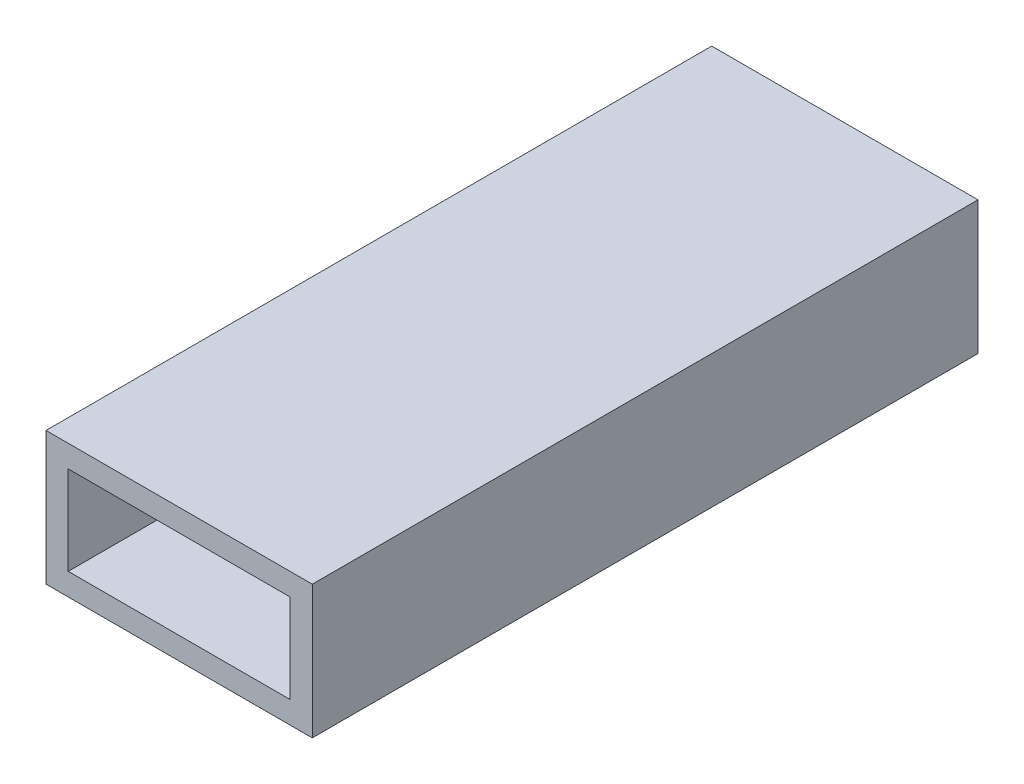
ISO-10303-21;
HEADER;
FILE_DESCRIPTION(('STEP AP214'),'2;1');
FILE_NAME('part.step','',(''),(''),'','','');
FILE_SCHEMA(('AUTOMOTIVE_DESIGN { 1 0 10303 214 1 1 1 1 }'));
ENDSEC;
DATA;
#1=APPLICATION_CONTEXT('core data for automotive mechanical design processes');
#2=APPLICATION_PROTOCOL_DEFINITION('international standard','automotive_design',2000,#1);
#3=PRODUCT_CONTEXT('',#1,'mechanical');
#4=PRODUCT('Part','Part','',(#3));
#5=PRODUCT_RELATED_PRODUCT_CATEGORY('part','',(#4));
#6=PRODUCT_DEFINITION_FORMATION('','',#4);
#7=PRODUCT_DEFINITION_CONTEXT('part definition',#1,'design');
#8=PRODUCT_DEFINITION('design','',#6,#7);
#9=PRODUCT_DEFINITION_SHAPE('','',#8);
#10=(LENGTH_UNIT() NAMED_UNIT(*) SI_UNIT(.MILLI.,.METRE.));
#11=(NAMED_UNIT(*) PLANE_ANGLE_UNIT() SI_UNIT($,.RADIAN.));
#12=(NAMED_UNIT(*) SI_UNIT($,.STERADIAN.) SOLID_ANGLE_UNIT());
#13=UNCERTAINTY_MEASURE_WITH_UNIT(LENGTH_MEASURE(1.E-05),#10,'distance_accuracy_value','');
#14=(GEOMETRIC_REPRESENTATION_CONTEXT(3) GLOBAL_UNCERTAINTY_ASSIGNED_CONTEXT((#13)) GLOBAL_UNIT_ASSIGNED_CONTEXT((#10,
#11,#12)) REPRESENTATION_CONTEXT('',''));
#15=CARTESIAN_POINT('',(0.,0.,0.));
#16=DIRECTION('',(0.,0.,1.));
#17=DIRECTION('',(1.,0.,0.));
#18=AXIS2_PLACEMENT_3D('',#15,#16,#17);
#19=CARTESIAN_POINT('',(-30.,30.,75.));
#20=DIRECTION('',(0.,0.,-1.));
#21=DIRECTION('',(-1.,0.,0.));
#22=AXIS2_PLACEMENT_3D('',#19,#20,#21);
#23=PLANE('',#22);
#24=DIRECTION('',(1.,0.,0.));
#25=VECTOR('',#24,1.);
#26=CARTESIAN_POINT('',(-30.,0.,75.));
#27=LINE('',#26,#25);
#28=CARTESIAN_POINT('',(-30.,0.,75.));
#29=VERTEX_POINT('',#28);
#30=CARTESIAN_POINT('',(30.,0.,75.));
#31=VERTEX_POINT('',#30);
#32=EDGE_CURVE('E158',#29,#31,#27,.T.);
#33=ORIENTED_EDGE('',*,*,#32,.T.);
#34=DIRECTION('',(0.,-1.,0.));
#35=VECTOR('',#34,1.);
#36=CARTESIAN_POINT('',(30.,30.,75.));
#37=LINE('',#36,#35);
#38=CARTESIAN_POINT('',(30.,30.,75.));
#39=VERTEX_POINT('',#38);
#40=EDGE_CURVE('E43',#39,#31,#37,.T.);
#41=ORIENTED_EDGE('',*,*,#40,.F.);
#42=DIRECTION('',(1.,0.,0.));
#43=VECTOR('',#42,1.);
#44=CARTESIAN_POINT('',(-30.,30.,75.));
#45=LINE('',#44,#43);
#46=CARTESIAN_POINT('',(-30.,30.,75.));
#47=VERTEX_POINT('',#46);
#48=EDGE_CURVE('E87',#47,#39,#45,.T.);
#49=ORIENTED_EDGE('',*,*,#48,.F.);
#50=DIRECTION('',(0.,-1.,0.));
#51=VECTOR('',#50,1.);
#52=CARTESIAN_POINT('',(-30.,30.,75.));
#53=LINE('',#52,#51);
#54=EDGE_CURVE('E11',#47,#29,#53,.T.);
#55=ORIENTED_EDGE('',*,*,#54,.T.);
#56=EDGE_LOOP('',(#33,#41,#49,#55));
#57=FACE_BOUND('',#56,.T.);
#58=DIRECTION('',(0.,-1.,0.));
#59=VECTOR('',#58,1.);
#60=CARTESIAN_POINT('',(-25.,25.,75.));
#61=LINE('',#60,#59);
#62=CARTESIAN_POINT('',(-25.,25.,75.));
#63=VERTEX_POINT('',#62);
#64=CARTESIAN_POINT('',(-25.,5.,75.));
#65=VERTEX_POINT('',#64);
#66=EDGE_CURVE('E117',#63,#65,#61,.T.);
#67=ORIENTED_EDGE('',*,*,#66,.F.);
#68=DIRECTION('',(-1.,0.,0.));
#69=VECTOR('',#68,1.);
#70=CARTESIAN_POINT('',(-25.,25.,75.));
#71=LINE('',#70,#69);
#72=CARTESIAN_POINT('',(25.,25.,75.));
#73=VERTEX_POINT('',#72);
#74=EDGE_CURVE('E143',#73,#63,#71,.T.);
#75=ORIENTED_EDGE('',*,*,#74,.F.);
#76=DIRECTION('',(0.,1.,0.));
#77=VECTOR('',#76,1.);
#78=CARTESIAN_POINT('',(25.,25.,75.));
#79=LINE('',#78,#77);
#80=CARTESIAN_POINT('',(25.,5.,75.));
#81=VERTEX_POINT('',#80);
#82=EDGE_CURVE('E141',#81,#73,#79,.T.);
#83=ORIENTED_EDGE('',*,*,#82,.F.);
#84=DIRECTION('',(1.,0.,0.));
#85=VECTOR('',#84,1.);
#86=CARTESIAN_POINT('',(-25.,5.,75.));
#87=LINE('',#86,#85);
#88=EDGE_CURVE('E139',#65,#81,#87,.T.);
#89=ORIENTED_EDGE('',*,*,#88,.F.);
#90=EDGE_LOOP('',(#67,#75,#83,#89));
#91=FACE_BOUND('',#90,.T.);
#92=ADVANCED_FACE('F35',(#57,#91),#23,.F.);
#93=CARTESIAN_POINT('',(-30.,30.,-75.));
#94=DIRECTION('',(1.,0.,0.));
#95=DIRECTION('',(0.,0.,-1.));
#96=AXIS2_PLACEMENT_3D('',#93,#94,#95);
#97=PLANE('',#96);
#98=DIRECTION('',(0.,0.,1.));
#99=VECTOR('',#98,1.);
#100=CARTESIAN_POINT('',(-30.,0.,-75.));
#101=LINE('',#100,#99);
#102=CARTESIAN_POINT('',(-30.,0.,-75.));
#103=VERTEX_POINT('',#102);
#104=EDGE_CURVE('E120',#103,#29,#101,.T.);
#105=ORIENTED_EDGE('',*,*,#104,.T.);
#106=ORIENTED_EDGE('',*,*,#54,.F.);
#107=DIRECTION('',(0.,0.,1.));
#108=VECTOR('',#107,1.);
#109=CARTESIAN_POINT('',(-30.,30.,-75.));
#110=LINE('',#109,#108);
#111=CARTESIAN_POINT('',(-30.,30.,-75.));
#112=VERTEX_POINT('',#111);
#113=EDGE_CURVE('E149',#112,#47,#110,.T.);
#114=ORIENTED_EDGE('',*,*,#113,.F.);
#115=DIRECTION('',(0.,-1.,0.));
#116=VECTOR('',#115,1.);
#117=CARTESIAN_POINT('',(-30.,30.,-75.));
#118=LINE('',#117,#116);
#119=EDGE_CURVE('E155',#112,#103,#118,.T.);
#120=ORIENTED_EDGE('',*,*,#119,.T.);
#121=EDGE_LOOP('',(#105,#106,#114,#120));
#122=FACE_BOUND('',#121,.T.);
#123=ADVANCED_FACE('F37',(#122),#97,.F.);
#124=CARTESIAN_POINT('',(30.,30.,-75.));
#125=DIRECTION('',(-1.,0.,0.));
#126=DIRECTION('',(0.,0.,1.));
#127=AXIS2_PLACEMENT_3D('',#124,#125,#126);
#128=PLANE('',#127);
#129=DIRECTION('',(0.,0.,-1.));
#130=VECTOR('',#129,1.);
#131=CARTESIAN_POINT('',(30.,0.,-75.));
#132=LINE('',#131,#130);
#133=CARTESIAN_POINT('',(30.,0.,-75.));
#134=VERTEX_POINT('',#133);
#135=EDGE_CURVE('E160',#31,#134,#132,.T.);
#136=ORIENTED_EDGE('',*,*,#135,.T.);
#137=DIRECTION('',(0.,-1.,0.));
#138=VECTOR('',#137,1.);
#139=CARTESIAN_POINT('',(30.,30.,-75.));
#140=LINE('',#139,#138);
#141=CARTESIAN_POINT('',(30.,30.,-75.));
#142=VERTEX_POINT('',#141);
#143=EDGE_CURVE('E164',#142,#134,#140,.T.);
#144=ORIENTED_EDGE('',*,*,#143,.F.);
#145=DIRECTION('',(0.,0.,-1.));
#146=VECTOR('',#145,1.);
#147=CARTESIAN_POINT('',(30.,30.,-75.));
#148=LINE('',#147,#146);
#149=EDGE_CURVE('E152',#39,#142,#148,.T.);
#150=ORIENTED_EDGE('',*,*,#149,.F.);
#151=ORIENTED_EDGE('',*,*,#40,.T.);
#152=EDGE_LOOP('',(#136,#144,#150,#151));
#153=FACE_BOUND('',#152,.T.);
#154=ADVANCED_FACE('F169',(#153),#128,.F.);
#155=CARTESIAN_POINT('',(-30.,30.,-75.));
#156=DIRECTION('',(0.,0.,1.));
#157=DIRECTION('',(1.,0.,0.));
#158=AXIS2_PLACEMENT_3D('',#155,#156,#157);
#159=PLANE('',#158);
#160=DIRECTION('',(-1.,0.,0.));
#161=VECTOR('',#160,1.);
#162=CARTESIAN_POINT('',(-30.,0.,-75.));
#163=LINE('',#162,#161);
#164=EDGE_CURVE('E80',#134,#103,#163,.T.);
#165=ORIENTED_EDGE('',*,*,#164,.T.);
#166=ORIENTED_EDGE('',*,*,#119,.F.);
#167=DIRECTION('',(-1.,0.,0.));
#168=VECTOR('',#167,1.);
#169=CARTESIAN_POINT('',(-30.,30.,-75.));
#170=LINE('',#169,#168);
#171=EDGE_CURVE('E59',#142,#112,#170,.T.);
#172=ORIENTED_EDGE('',*,*,#171,.F.);
#173=ORIENTED_EDGE('',*,*,#143,.T.);
#174=EDGE_LOOP('',(#165,#166,#172,#173));
#175=FACE_BOUND('',#174,.T.);
#176=ADVANCED_FACE('F177',(#175),#159,.F.);
#177=CARTESIAN_POINT('',(-30.,30.,75.));
#178=DIRECTION('',(0.,1.,0.));
#179=DIRECTION('',(0.,0.,1.));
#180=AXIS2_PLACEMENT_3D('',#177,#178,#179);
#181=PLANE('',#180);
#182=ORIENTED_EDGE('',*,*,#113,.T.);
#183=ORIENTED_EDGE('',*,*,#48,.T.);
#184=ORIENTED_EDGE('',*,*,#149,.T.);
#185=ORIENTED_EDGE('',*,*,#171,.T.);
#186=EDGE_LOOP('',(#182,#183,#184,#185));
#187=FACE_BOUND('',#186,.T.);
#188=ADVANCED_FACE('F179',(#187),#181,.T.);
#189=CARTESIAN_POINT('',(-30.,0.,75.));
#190=DIRECTION('',(0.,1.,0.));
#191=DIRECTION('',(0.,0.,1.));
#192=AXIS2_PLACEMENT_3D('',#189,#190,#191);
#193=PLANE('',#192);
#194=ORIENTED_EDGE('',*,*,#104,.F.);
#195=ORIENTED_EDGE('',*,*,#164,.F.);
#196=ORIENTED_EDGE('',*,*,#135,.F.);
#197=ORIENTED_EDGE('',*,*,#32,.F.);
#198=EDGE_LOOP('',(#194,#195,#196,#197));
#199=FACE_BOUND('',#198,.T.);
#200=ADVANCED_FACE('F173',(#199),#193,.F.);
#201=CARTESIAN_POINT('',(-25.,25.,75.));
#202=DIRECTION('',(1.,0.,0.));
#203=DIRECTION('',(0.,1.,0.));
#204=AXIS2_PLACEMENT_3D('',#201,#202,#203);
#205=PLANE('',#204);
#206=DIRECTION('',(0.,0.,-1.));
#207=VECTOR('',#206,1.);
#208=CARTESIAN_POINT('',(-25.,25.,75.));
#209=LINE('',#208,#207);
#210=CARTESIAN_POINT('',(-25.,25.,-70.));
#211=VERTEX_POINT('',#210);
#212=EDGE_CURVE('E145',#63,#211,#209,.T.);
#213=ORIENTED_EDGE('',*,*,#212,.F.);
#214=ORIENTED_EDGE('',*,*,#66,.T.);
#215=DIRECTION('',(0.,0.,-1.));
#216=VECTOR('',#215,1.);
#217=CARTESIAN_POINT('',(-25.,5.,75.));
#218=LINE('',#217,#216);
#219=CARTESIAN_POINT('',(-25.,5.,-70.));
#220=VERTEX_POINT('',#219);
#221=EDGE_CURVE('E109',#65,#220,#218,.T.);
#222=ORIENTED_EDGE('',*,*,#221,.T.);
#223=DIRECTION('',(0.,-1.,0.));
#224=VECTOR('',#223,1.);
#225=CARTESIAN_POINT('',(-25.,25.,-70.));
#226=LINE('',#225,#224);
#227=EDGE_CURVE('E114',#211,#220,#226,.T.);
#228=ORIENTED_EDGE('',*,*,#227,.F.);
#229=EDGE_LOOP('',(#213,#214,#222,#228));
#230=FACE_BOUND('',#229,.T.);
#231=ADVANCED_FACE('F112',(#230),#205,.T.);
#232=CARTESIAN_POINT('',(-25.,5.,75.));
#233=DIRECTION('',(0.,1.,0.));
#234=DIRECTION('',(0.,0.,1.));
#235=AXIS2_PLACEMENT_3D('',#232,#233,#234);
#236=PLANE('',#235);
#237=ORIENTED_EDGE('',*,*,#221,.F.);
#238=ORIENTED_EDGE('',*,*,#88,.T.);
#239=DIRECTION('',(0.,0.,-1.));
#240=VECTOR('',#239,1.);
#241=CARTESIAN_POINT('',(25.,5.,75.));
#242=LINE('',#241,#240);
#243=CARTESIAN_POINT('',(25.,5.,-70.));
#244=VERTEX_POINT('',#243);
#245=EDGE_CURVE('E121',#81,#244,#242,.T.);
#246=ORIENTED_EDGE('',*,*,#245,.T.);
#247=DIRECTION('',(1.,0.,0.));
#248=VECTOR('',#247,1.);
#249=CARTESIAN_POINT('',(-25.,5.,-70.));
#250=LINE('',#249,#248);
#251=EDGE_CURVE('E124',#220,#244,#250,.T.);
#252=ORIENTED_EDGE('',*,*,#251,.F.);
#253=EDGE_LOOP('',(#237,#238,#246,#252));
#254=FACE_BOUND('',#253,.T.);
#255=ADVANCED_FACE('F125',(#254),#236,.T.);
#256=CARTESIAN_POINT('',(25.,25.,75.));
#257=DIRECTION('',(-1.,0.,0.));
#258=DIRECTION('',(0.,-1.,0.));
#259=AXIS2_PLACEMENT_3D('',#256,#257,#258);
#260=PLANE('',#259);
#261=ORIENTED_EDGE('',*,*,#245,.F.);
#262=ORIENTED_EDGE('',*,*,#82,.T.);
#263=DIRECTION('',(0.,0.,-1.));
#264=VECTOR('',#263,1.);
#265=CARTESIAN_POINT('',(25.,25.,75.));
#266=LINE('',#265,#264);
#267=CARTESIAN_POINT('',(25.,25.,-70.));
#268=VERTEX_POINT('',#267);
#269=EDGE_CURVE('E50',#73,#268,#266,.T.);
#270=ORIENTED_EDGE('',*,*,#269,.T.);
#271=DIRECTION('',(0.,1.,0.));
#272=VECTOR('',#271,1.);
#273=CARTESIAN_POINT('',(25.,25.,-70.));
#274=LINE('',#273,#272);
#275=EDGE_CURVE('E130',#244,#268,#274,.T.);
#276=ORIENTED_EDGE('',*,*,#275,.F.);
#277=EDGE_LOOP('',(#261,#262,#270,#276));
#278=FACE_BOUND('',#277,.T.);
#279=ADVANCED_FACE('F196',(#278),#260,.T.);
#280=CARTESIAN_POINT('',(-25.,25.,75.));
#281=DIRECTION('',(0.,-1.,0.));
#282=DIRECTION('',(1.,0.,0.));
#283=AXIS2_PLACEMENT_3D('',#280,#281,#282);
#284=PLANE('',#283);
#285=ORIENTED_EDGE('',*,*,#269,.F.);
#286=ORIENTED_EDGE('',*,*,#74,.T.);
#287=ORIENTED_EDGE('',*,*,#212,.T.);
#288=DIRECTION('',(-1.,0.,0.));
#289=VECTOR('',#288,1.);
#290=CARTESIAN_POINT('',(-25.,25.,-70.));
#291=LINE('',#290,#289);
#292=EDGE_CURVE('E133',#268,#211,#291,.T.);
#293=ORIENTED_EDGE('',*,*,#292,.F.);
#294=EDGE_LOOP('',(#285,#286,#287,#293));
#295=FACE_BOUND('',#294,.T.);
#296=ADVANCED_FACE('F197',(#295),#284,.T.);
#297=CARTESIAN_POINT('',(-25.,5.,-70.));
#298=DIRECTION('',(0.,0.,1.));
#299=DIRECTION('',(1.,0.,0.));
#300=AXIS2_PLACEMENT_3D('',#297,#298,#299);
#301=PLANE('',#300);
#302=ORIENTED_EDGE('',*,*,#227,.T.);
#303=ORIENTED_EDGE('',*,*,#251,.T.);
#304=ORIENTED_EDGE('',*,*,#275,.T.);
#305=ORIENTED_EDGE('',*,*,#292,.T.);
#306=EDGE_LOOP('',(#302,#303,#304,#305));
#307=FACE_BOUND('',#306,.T.);
#308=ADVANCED_FACE('F132',(#307),#301,.T.);
#309=CLOSED_SHELL('',(#92,#123,#154,#176,#188,#200,#231,#255,#279,#296,#308));
#310=MANIFOLD_SOLID_BREP('B2',#309);
#311=ADVANCED_BREP_SHAPE_REPRESENTATION('',(#18,#310),#14);
#312=SHAPE_DEFINITION_REPRESENTATION(#9,#311);
ENDSEC;
END-ISO-10303-21;
